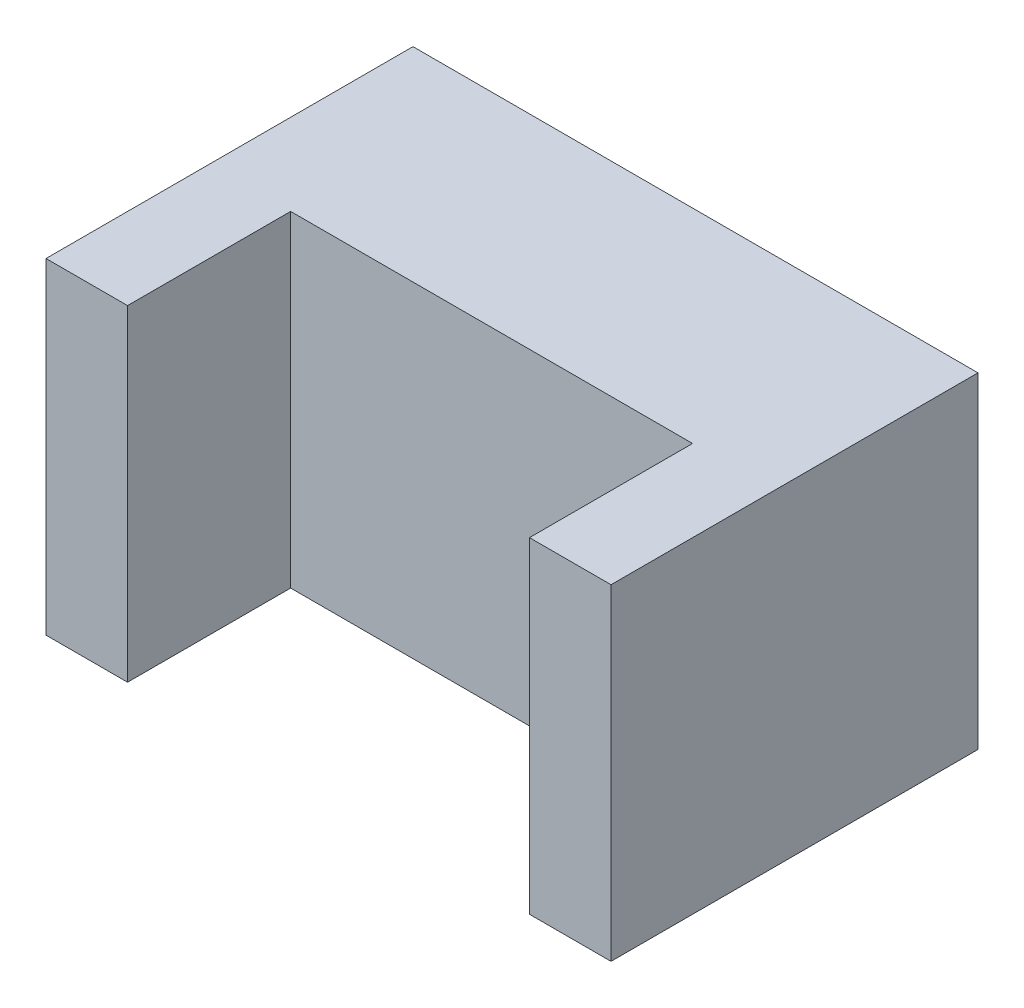
ISO-10303-21;
HEADER;
FILE_DESCRIPTION(('STEP AP214'),'2;1');
FILE_NAME('part.step','',(''),(''),'','','');
FILE_SCHEMA(('AUTOMOTIVE_DESIGN { 1 0 10303 214 1 1 1 1 }'));
ENDSEC;
DATA;
#1=APPLICATION_CONTEXT('core data for automotive mechanical design processes');
#2=APPLICATION_PROTOCOL_DEFINITION('international standard','automotive_design',2000,#1);
#3=PRODUCT_CONTEXT('',#1,'mechanical');
#4=PRODUCT('Part','Part','',(#3));
#5=PRODUCT_RELATED_PRODUCT_CATEGORY('part','',(#4));
#6=PRODUCT_DEFINITION_FORMATION('','',#4);
#7=PRODUCT_DEFINITION_CONTEXT('part definition',#1,'design');
#8=PRODUCT_DEFINITION('design','',#6,#7);
#9=PRODUCT_DEFINITION_SHAPE('','',#8);
#10=(LENGTH_UNIT() NAMED_UNIT(*) SI_UNIT(.MILLI.,.METRE.));
#11=(NAMED_UNIT(*) PLANE_ANGLE_UNIT() SI_UNIT($,.RADIAN.));
#12=(NAMED_UNIT(*) SI_UNIT($,.STERADIAN.) SOLID_ANGLE_UNIT());
#13=UNCERTAINTY_MEASURE_WITH_UNIT(LENGTH_MEASURE(1.E-05),#10,'distance_accuracy_value','');
#14=(GEOMETRIC_REPRESENTATION_CONTEXT(3) GLOBAL_UNCERTAINTY_ASSIGNED_CONTEXT((#13)) GLOBAL_UNIT_ASSIGNED_CONTEXT((#10,
#11,#12)) REPRESENTATION_CONTEXT('',''));
#15=CARTESIAN_POINT('',(0.,0.,0.));
#16=DIRECTION('',(0.,0.,1.));
#17=DIRECTION('',(1.,0.,0.));
#18=AXIS2_PLACEMENT_3D('',#15,#16,#17);
#19=CARTESIAN_POINT('',(-1.64285714285714,4.,0.));
#20=DIRECTION('',(0.,0.,-1.));
#21=DIRECTION('',(-1.,0.,0.));
#22=AXIS2_PLACEMENT_3D('',#19,#20,#21);
#23=PLANE('',#22);
#24=DIRECTION('',(1.,0.,0.));
#25=VECTOR('',#24,1.);
#26=CARTESIAN_POINT('',(-1.64285714285714,0.,0.));
#27=LINE('',#26,#25);
#28=CARTESIAN_POINT('',(-2.64285714285714,0.,0.));
#29=VERTEX_POINT('',#28);
#30=CARTESIAN_POINT('',(-1.64285714285714,0.,0.));
#31=VERTEX_POINT('',#30);
#32=EDGE_CURVE('E140',#29,#31,#27,.T.);
#33=ORIENTED_EDGE('',*,*,#32,.T.);
#34=DIRECTION('',(0.,-1.,0.));
#35=VECTOR('',#34,1.);
#36=CARTESIAN_POINT('',(-1.64285714285714,4.,0.));
#37=LINE('',#36,#35);
#38=CARTESIAN_POINT('',(-1.64285714285714,4.,0.));
#39=VERTEX_POINT('',#38);
#40=EDGE_CURVE('E11',#39,#31,#37,.T.);
#41=ORIENTED_EDGE('',*,*,#40,.F.);
#42=DIRECTION('',(1.,0.,0.));
#43=VECTOR('',#42,1.);
#44=CARTESIAN_POINT('',(-1.64285714285714,4.,0.));
#45=LINE('',#44,#43);
#46=CARTESIAN_POINT('',(-2.64285714285714,4.,0.));
#47=VERTEX_POINT('',#46);
#48=EDGE_CURVE('E162',#47,#39,#45,.T.);
#49=ORIENTED_EDGE('',*,*,#48,.F.);
#50=DIRECTION('',(0.,-1.,0.));
#51=VECTOR('',#50,1.);
#52=CARTESIAN_POINT('',(-2.64285714285714,4.,0.));
#53=LINE('',#52,#51);
#54=EDGE_CURVE('E136',#47,#29,#53,.T.);
#55=ORIENTED_EDGE('',*,*,#54,.T.);
#56=EDGE_LOOP('',(#33,#41,#49,#55));
#57=FACE_BOUND('',#56,.T.);
#58=ADVANCED_FACE('F39',(#57),#23,.F.);
#59=CARTESIAN_POINT('',(-1.64285714285714,4.,-2.));
#60=DIRECTION('',(-1.,0.,0.));
#61=DIRECTION('',(0.,0.,1.));
#62=AXIS2_PLACEMENT_3D('',#59,#60,#61);
#63=PLANE('',#62);
#64=DIRECTION('',(0.,0.,-1.));
#65=VECTOR('',#64,1.);
#66=CARTESIAN_POINT('',(-1.64285714285714,0.,-2.));
#67=LINE('',#66,#65);
#68=CARTESIAN_POINT('',(-1.64285714285714,0.,-2.));
#69=VERTEX_POINT('',#68);
#70=EDGE_CURVE('E144',#31,#69,#67,.T.);
#71=ORIENTED_EDGE('',*,*,#70,.T.);
#72=DIRECTION('',(0.,-1.,0.));
#73=VECTOR('',#72,1.);
#74=CARTESIAN_POINT('',(-1.64285714285714,4.,-2.));
#75=LINE('',#74,#73);
#76=CARTESIAN_POINT('',(-1.64285714285714,4.,-2.));
#77=VERTEX_POINT('',#76);
#78=EDGE_CURVE('E48',#77,#69,#75,.T.);
#79=ORIENTED_EDGE('',*,*,#78,.F.);
#80=DIRECTION('',(0.,0.,-1.));
#81=VECTOR('',#80,1.);
#82=CARTESIAN_POINT('',(-1.64285714285714,4.,-2.));
#83=LINE('',#82,#81);
#84=EDGE_CURVE('E99',#39,#77,#83,.T.);
#85=ORIENTED_EDGE('',*,*,#84,.F.);
#86=ORIENTED_EDGE('',*,*,#40,.T.);
#87=EDGE_LOOP('',(#71,#79,#85,#86));
#88=FACE_BOUND('',#87,.T.);
#89=ADVANCED_FACE('F208',(#88),#63,.F.);
#90=CARTESIAN_POINT('',(3.28571428571428,4.,-2.));
#91=DIRECTION('',(0.,0.,-1.));
#92=DIRECTION('',(-1.,0.,0.));
#93=AXIS2_PLACEMENT_3D('',#90,#91,#92);
#94=PLANE('',#93);
#95=DIRECTION('',(1.,0.,0.));
#96=VECTOR('',#95,1.);
#97=CARTESIAN_POINT('',(3.28571428571428,0.,-2.));
#98=LINE('',#97,#96);
#99=CARTESIAN_POINT('',(3.28571428571428,0.,-2.));
#100=VERTEX_POINT('',#99);
#101=EDGE_CURVE('E147',#69,#100,#98,.T.);
#102=ORIENTED_EDGE('',*,*,#101,.T.);
#103=DIRECTION('',(0.,-1.,0.));
#104=VECTOR('',#103,1.);
#105=CARTESIAN_POINT('',(3.28571428571428,4.,-2.));
#106=LINE('',#105,#104);
#107=CARTESIAN_POINT('',(3.28571428571428,4.,-2.));
#108=VERTEX_POINT('',#107);
#109=EDGE_CURVE('E173',#108,#100,#106,.T.);
#110=ORIENTED_EDGE('',*,*,#109,.F.);
#111=DIRECTION('',(1.,0.,0.));
#112=VECTOR('',#111,1.);
#113=CARTESIAN_POINT('',(3.28571428571428,4.,-2.));
#114=LINE('',#113,#112);
#115=EDGE_CURVE('E183',#77,#108,#114,.T.);
#116=ORIENTED_EDGE('',*,*,#115,.F.);
#117=ORIENTED_EDGE('',*,*,#78,.T.);
#118=EDGE_LOOP('',(#102,#110,#116,#117));
#119=FACE_BOUND('',#118,.T.);
#120=ADVANCED_FACE('F181',(#119),#94,.F.);
#121=CARTESIAN_POINT('',(3.28571428571428,4.,0.));
#122=DIRECTION('',(1.,0.,0.));
#123=DIRECTION('',(0.,0.,-1.));
#124=AXIS2_PLACEMENT_3D('',#121,#122,#123);
#125=PLANE('',#124);
#126=DIRECTION('',(0.,0.,1.));
#127=VECTOR('',#126,1.);
#128=CARTESIAN_POINT('',(3.28571428571428,0.,0.));
#129=LINE('',#128,#127);
#130=CARTESIAN_POINT('',(3.28571428571428,0.,0.));
#131=VERTEX_POINT('',#130);
#132=EDGE_CURVE('E150',#100,#131,#129,.T.);
#133=ORIENTED_EDGE('',*,*,#132,.T.);
#134=DIRECTION('',(0.,-1.,0.));
#135=VECTOR('',#134,1.);
#136=CARTESIAN_POINT('',(3.28571428571428,4.,0.));
#137=LINE('',#136,#135);
#138=CARTESIAN_POINT('',(3.28571428571428,4.,0.));
#139=VERTEX_POINT('',#138);
#140=EDGE_CURVE('E169',#139,#131,#137,.T.);
#141=ORIENTED_EDGE('',*,*,#140,.F.);
#142=DIRECTION('',(0.,0.,1.));
#143=VECTOR('',#142,1.);
#144=CARTESIAN_POINT('',(3.28571428571428,4.,0.));
#145=LINE('',#144,#143);
#146=EDGE_CURVE('E196',#108,#139,#145,.T.);
#147=ORIENTED_EDGE('',*,*,#146,.F.);
#148=ORIENTED_EDGE('',*,*,#109,.T.);
#149=EDGE_LOOP('',(#133,#141,#147,#148));
#150=FACE_BOUND('',#149,.T.);
#151=ADVANCED_FACE('F191',(#150),#125,.F.);
#152=CARTESIAN_POINT('',(4.28571428571428,4.,0.));
#153=DIRECTION('',(0.,0.,-1.));
#154=DIRECTION('',(-1.,0.,0.));
#155=AXIS2_PLACEMENT_3D('',#152,#153,#154);
#156=PLANE('',#155);
#157=DIRECTION('',(1.,0.,0.));
#158=VECTOR('',#157,1.);
#159=CARTESIAN_POINT('',(4.28571428571428,0.,0.));
#160=LINE('',#159,#158);
#161=CARTESIAN_POINT('',(4.28571428571428,0.,0.));
#162=VERTEX_POINT('',#161);
#163=EDGE_CURVE('E153',#131,#162,#160,.T.);
#164=ORIENTED_EDGE('',*,*,#163,.T.);
#165=DIRECTION('',(0.,-1.,0.));
#166=VECTOR('',#165,1.);
#167=CARTESIAN_POINT('',(4.28571428571428,4.,0.));
#168=LINE('',#167,#166);
#169=CARTESIAN_POINT('',(4.28571428571428,4.,0.));
#170=VERTEX_POINT('',#169);
#171=EDGE_CURVE('E129',#170,#162,#168,.T.);
#172=ORIENTED_EDGE('',*,*,#171,.F.);
#173=DIRECTION('',(1.,0.,0.));
#174=VECTOR('',#173,1.);
#175=CARTESIAN_POINT('',(4.28571428571428,4.,0.));
#176=LINE('',#175,#174);
#177=EDGE_CURVE('E118',#139,#170,#176,.T.);
#178=ORIENTED_EDGE('',*,*,#177,.F.);
#179=ORIENTED_EDGE('',*,*,#140,.T.);
#180=EDGE_LOOP('',(#164,#172,#178,#179));
#181=FACE_BOUND('',#180,.T.);
#182=ADVANCED_FACE('F194',(#181),#156,.F.);
#183=CARTESIAN_POINT('',(4.28571428571428,4.,-4.5));
#184=DIRECTION('',(-1.,0.,0.));
#185=DIRECTION('',(0.,0.,1.));
#186=AXIS2_PLACEMENT_3D('',#183,#184,#185);
#187=PLANE('',#186);
#188=DIRECTION('',(0.,0.,-1.));
#189=VECTOR('',#188,1.);
#190=CARTESIAN_POINT('',(4.28571428571428,0.,-4.5));
#191=LINE('',#190,#189);
#192=CARTESIAN_POINT('',(4.28571428571428,0.,-4.5));
#193=VERTEX_POINT('',#192);
#194=EDGE_CURVE('E127',#162,#193,#191,.T.);
#195=ORIENTED_EDGE('',*,*,#194,.T.);
#196=DIRECTION('',(0.,-1.,0.));
#197=VECTOR('',#196,1.);
#198=CARTESIAN_POINT('',(4.28571428571428,4.,-4.5));
#199=LINE('',#198,#197);
#200=CARTESIAN_POINT('',(4.28571428571428,4.,-4.5));
#201=VERTEX_POINT('',#200);
#202=EDGE_CURVE('E124',#201,#193,#199,.T.);
#203=ORIENTED_EDGE('',*,*,#202,.F.);
#204=DIRECTION('',(0.,0.,-1.));
#205=VECTOR('',#204,1.);
#206=CARTESIAN_POINT('',(4.28571428571428,4.,-4.5));
#207=LINE('',#206,#205);
#208=EDGE_CURVE('E112',#170,#201,#207,.T.);
#209=ORIENTED_EDGE('',*,*,#208,.F.);
#210=ORIENTED_EDGE('',*,*,#171,.T.);
#211=EDGE_LOOP('',(#195,#203,#209,#210));
#212=FACE_BOUND('',#211,.T.);
#213=ADVANCED_FACE('F125',(#212),#187,.F.);
#214=CARTESIAN_POINT('',(-2.64285714285714,4.,-4.5));
#215=DIRECTION('',(0.,0.,1.));
#216=DIRECTION('',(1.,0.,0.));
#217=AXIS2_PLACEMENT_3D('',#214,#215,#216);
#218=PLANE('',#217);
#219=DIRECTION('',(-1.,0.,0.));
#220=VECTOR('',#219,1.);
#221=CARTESIAN_POINT('',(-2.64285714285714,0.,-4.5));
#222=LINE('',#221,#220);
#223=CARTESIAN_POINT('',(-2.64285714285714,0.,-4.5));
#224=VERTEX_POINT('',#223);
#225=EDGE_CURVE('E85',#193,#224,#222,.T.);
#226=ORIENTED_EDGE('',*,*,#225,.T.);
#227=DIRECTION('',(0.,-1.,0.));
#228=VECTOR('',#227,1.);
#229=CARTESIAN_POINT('',(-2.64285714285714,4.,-4.5));
#230=LINE('',#229,#228);
#231=CARTESIAN_POINT('',(-2.64285714285714,4.,-4.5));
#232=VERTEX_POINT('',#231);
#233=EDGE_CURVE('E130',#232,#224,#230,.T.);
#234=ORIENTED_EDGE('',*,*,#233,.F.);
#235=DIRECTION('',(-1.,0.,0.));
#236=VECTOR('',#235,1.);
#237=CARTESIAN_POINT('',(-2.64285714285714,4.,-4.5));
#238=LINE('',#237,#236);
#239=EDGE_CURVE('E116',#201,#232,#238,.T.);
#240=ORIENTED_EDGE('',*,*,#239,.F.);
#241=ORIENTED_EDGE('',*,*,#202,.T.);
#242=EDGE_LOOP('',(#226,#234,#240,#241));
#243=FACE_BOUND('',#242,.T.);
#244=ADVANCED_FACE('F132',(#243),#218,.F.);
#245=CARTESIAN_POINT('',(-2.64285714285714,4.,0.));
#246=DIRECTION('',(1.,0.,0.));
#247=DIRECTION('',(0.,0.,-1.));
#248=AXIS2_PLACEMENT_3D('',#245,#246,#247);
#249=PLANE('',#248);
#250=DIRECTION('',(0.,0.,1.));
#251=VECTOR('',#250,1.);
#252=CARTESIAN_POINT('',(-2.64285714285714,0.,0.));
#253=LINE('',#252,#251);
#254=EDGE_CURVE('E91',#224,#29,#253,.T.);
#255=ORIENTED_EDGE('',*,*,#254,.T.);
#256=ORIENTED_EDGE('',*,*,#54,.F.);
#257=DIRECTION('',(0.,0.,1.));
#258=VECTOR('',#257,1.);
#259=CARTESIAN_POINT('',(-2.64285714285714,4.,0.));
#260=LINE('',#259,#258);
#261=EDGE_CURVE('E56',#232,#47,#260,.T.);
#262=ORIENTED_EDGE('',*,*,#261,.F.);
#263=ORIENTED_EDGE('',*,*,#233,.T.);
#264=EDGE_LOOP('',(#255,#256,#262,#263));
#265=FACE_BOUND('',#264,.T.);
#266=ADVANCED_FACE('F224',(#265),#249,.F.);
#267=CARTESIAN_POINT('',(0.,4.,0.));
#268=DIRECTION('',(0.,-1.,0.));
#269=DIRECTION('',(0.,0.,-1.));
#270=AXIS2_PLACEMENT_3D('',#267,#268,#269);
#271=PLANE('',#270);
#272=ORIENTED_EDGE('',*,*,#48,.T.);
#273=ORIENTED_EDGE('',*,*,#84,.T.);
#274=ORIENTED_EDGE('',*,*,#115,.T.);
#275=ORIENTED_EDGE('',*,*,#146,.T.);
#276=ORIENTED_EDGE('',*,*,#177,.T.);
#277=ORIENTED_EDGE('',*,*,#208,.T.);
#278=ORIENTED_EDGE('',*,*,#239,.T.);
#279=ORIENTED_EDGE('',*,*,#261,.T.);
#280=EDGE_LOOP('',(#272,#273,#274,#275,#276,#277,#278,#279));
#281=FACE_BOUND('',#280,.T.);
#282=ADVANCED_FACE('F114',(#281),#271,.F.);
#283=CARTESIAN_POINT('',(0.,0.,0.));
#284=DIRECTION('',(0.,-1.,0.));
#285=DIRECTION('',(0.,0.,-1.));
#286=AXIS2_PLACEMENT_3D('',#283,#284,#285);
#287=PLANE('',#286);
#288=ORIENTED_EDGE('',*,*,#32,.F.);
#289=ORIENTED_EDGE('',*,*,#254,.F.);
#290=ORIENTED_EDGE('',*,*,#225,.F.);
#291=ORIENTED_EDGE('',*,*,#194,.F.);
#292=ORIENTED_EDGE('',*,*,#163,.F.);
#293=ORIENTED_EDGE('',*,*,#132,.F.);
#294=ORIENTED_EDGE('',*,*,#101,.F.);
#295=ORIENTED_EDGE('',*,*,#70,.F.);
#296=EDGE_LOOP('',(#288,#289,#290,#291,#292,#293,#294,#295));
#297=FACE_BOUND('',#296,.T.);
#298=ADVANCED_FACE('F187',(#297),#287,.T.);
#299=CLOSED_SHELL('',(#58,#89,#120,#151,#182,#213,#244,#266,#282,#298));
#300=MANIFOLD_SOLID_BREP('B2',#299);
#301=ADVANCED_BREP_SHAPE_REPRESENTATION('',(#18,#300),#14);
#302=SHAPE_DEFINITION_REPRESENTATION(#9,#301);
ENDSEC;
END-ISO-10303-21;
